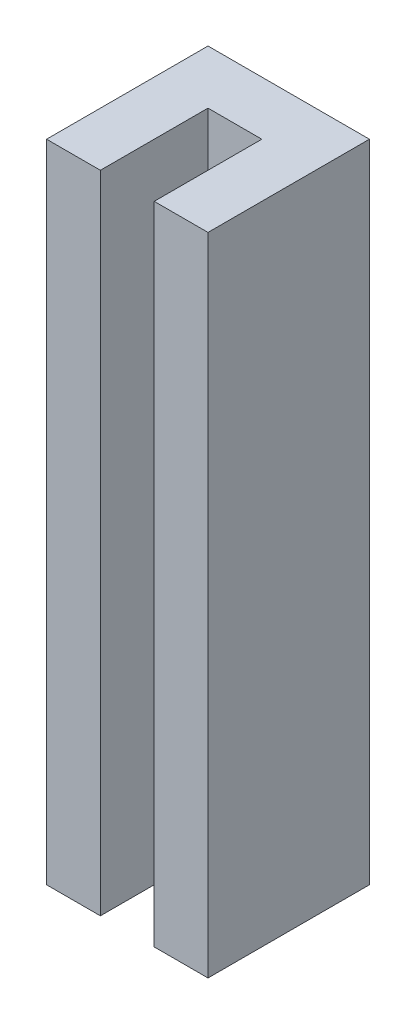
ISO-10303-21;
HEADER;
FILE_DESCRIPTION(('STEP AP214'),'2;1');
FILE_NAME('part.step','',(''),(''),'','','');
FILE_SCHEMA(('AUTOMOTIVE_DESIGN { 1 0 10303 214 1 1 1 1 }'));
ENDSEC;
DATA;
#1=APPLICATION_CONTEXT('core data for automotive mechanical design processes');
#2=APPLICATION_PROTOCOL_DEFINITION('international standard','automotive_design',2000,#1);
#3=PRODUCT_CONTEXT('',#1,'mechanical');
#4=PRODUCT('Part','Part','',(#3));
#5=PRODUCT_RELATED_PRODUCT_CATEGORY('part','',(#4));
#6=PRODUCT_DEFINITION_FORMATION('','',#4);
#7=PRODUCT_DEFINITION_CONTEXT('part definition',#1,'design');
#8=PRODUCT_DEFINITION('design','',#6,#7);
#9=PRODUCT_DEFINITION_SHAPE('','',#8);
#10=(LENGTH_UNIT() NAMED_UNIT(*) SI_UNIT(.MILLI.,.METRE.));
#11=(NAMED_UNIT(*) PLANE_ANGLE_UNIT() SI_UNIT($,.RADIAN.));
#12=(NAMED_UNIT(*) SI_UNIT($,.STERADIAN.) SOLID_ANGLE_UNIT());
#13=UNCERTAINTY_MEASURE_WITH_UNIT(LENGTH_MEASURE(1.E-05),#10,'distance_accuracy_value','');
#14=(GEOMETRIC_REPRESENTATION_CONTEXT(3) GLOBAL_UNCERTAINTY_ASSIGNED_CONTEXT((#13)) GLOBAL_UNIT_ASSIGNED_CONTEXT((#10,
#11,#12)) REPRESENTATION_CONTEXT('',''));
#15=CARTESIAN_POINT('',(0.,0.,0.));
#16=DIRECTION('',(0.,0.,1.));
#17=DIRECTION('',(1.,0.,0.));
#18=AXIS2_PLACEMENT_3D('',#15,#16,#17);
#19=CARTESIAN_POINT('',(4.7625,19.05,4.7625));
#20=DIRECTION('',(-1.,0.,0.));
#21=DIRECTION('',(0.,0.,1.));
#22=AXIS2_PLACEMENT_3D('',#19,#20,#21);
#23=PLANE('',#22);
#24=DIRECTION('',(0.,0.,-1.));
#25=VECTOR('',#24,1.);
#26=CARTESIAN_POINT('',(4.7625,-19.05,4.7625));
#27=LINE('',#26,#25);
#28=CARTESIAN_POINT('',(4.7625,-19.05,4.7625));
#29=VERTEX_POINT('',#28);
#30=CARTESIAN_POINT('',(4.7625,-19.05,-4.7625));
#31=VERTEX_POINT('',#30);
#32=EDGE_CURVE('E128',#29,#31,#27,.T.);
#33=ORIENTED_EDGE('',*,*,#32,.T.);
#34=DIRECTION('',(0.,-1.,0.));
#35=VECTOR('',#34,1.);
#36=CARTESIAN_POINT('',(4.7625,19.05,-4.7625));
#37=LINE('',#36,#35);
#38=CARTESIAN_POINT('',(4.7625,19.05,-4.7625));
#39=VERTEX_POINT('',#38);
#40=EDGE_CURVE('E11',#39,#31,#37,.T.);
#41=ORIENTED_EDGE('',*,*,#40,.F.);
#42=DIRECTION('',(0.,0.,-1.));
#43=VECTOR('',#42,1.);
#44=CARTESIAN_POINT('',(4.7625,19.05,4.7625));
#45=LINE('',#44,#43);
#46=CARTESIAN_POINT('',(4.7625,19.05,4.7625));
#47=VERTEX_POINT('',#46);
#48=EDGE_CURVE('E143',#47,#39,#45,.T.);
#49=ORIENTED_EDGE('',*,*,#48,.F.);
#50=DIRECTION('',(0.,-1.,0.));
#51=VECTOR('',#50,1.);
#52=CARTESIAN_POINT('',(4.7625,19.05,4.7625));
#53=LINE('',#52,#51);
#54=EDGE_CURVE('E124',#47,#29,#53,.T.);
#55=ORIENTED_EDGE('',*,*,#54,.T.);
#56=EDGE_LOOP('',(#33,#41,#49,#55));
#57=FACE_BOUND('',#56,.T.);
#58=ADVANCED_FACE('F30',(#57),#23,.F.);
#59=CARTESIAN_POINT('',(-4.7625,19.05,-4.7625));
#60=DIRECTION('',(0.,0.,1.));
#61=DIRECTION('',(1.,0.,0.));
#62=AXIS2_PLACEMENT_3D('',#59,#60,#61);
#63=PLANE('',#62);
#64=CARTESIAN_POINT('',(0.,7.9375,-4.7625));
#65=DIRECTION('',(0.,0.,-1.));
#66=DIRECTION('',(-1.,0.,0.));
#67=AXIS2_PLACEMENT_3D('',#64,#65,#66);
#68=CIRCLE('',#67,1.42239999999982);
#69=CARTESIAN_POINT('',(-1.42239999999983,7.9375,-4.7625));
#70=VERTEX_POINT('',#69);
#71=EDGE_CURVE('E163',#70,#70,#68,.T.);
#72=ORIENTED_EDGE('',*,*,#71,.F.);
#73=EDGE_LOOP('',(#72));
#74=FACE_BOUND('',#73,.T.);
#75=CARTESIAN_POINT('',(0.,-14.2875,-4.76250000000001));
#76=DIRECTION('',(0.,0.,-1.));
#77=DIRECTION('',(-1.,0.,0.));
#78=AXIS2_PLACEMENT_3D('',#75,#76,#77);
#79=CIRCLE('',#78,1.42239999999982);
#80=CARTESIAN_POINT('',(-1.42239999999983,-14.2875,-4.76250000000001));
#81=VERTEX_POINT('',#80);
#82=EDGE_CURVE('E155',#81,#81,#79,.T.);
#83=ORIENTED_EDGE('',*,*,#82,.F.);
#84=EDGE_LOOP('',(#83));
#85=FACE_BOUND('',#84,.T.);
#86=DIRECTION('',(-1.,0.,0.));
#87=VECTOR('',#86,1.);
#88=CARTESIAN_POINT('',(-4.7625,-19.05,-4.7625));
#89=LINE('',#88,#87);
#90=CARTESIAN_POINT('',(-4.7625,-19.05,-4.7625));
#91=VERTEX_POINT('',#90);
#92=EDGE_CURVE('E131',#31,#91,#89,.T.);
#93=ORIENTED_EDGE('',*,*,#92,.T.);
#94=DIRECTION('',(0.,-1.,0.));
#95=VECTOR('',#94,1.);
#96=CARTESIAN_POINT('',(-4.7625,19.05,-4.7625));
#97=LINE('',#96,#95);
#98=CARTESIAN_POINT('',(-4.7625,19.05,-4.7625));
#99=VERTEX_POINT('',#98);
#100=EDGE_CURVE('E39',#99,#91,#97,.T.);
#101=ORIENTED_EDGE('',*,*,#100,.F.);
#102=DIRECTION('',(-1.,0.,0.));
#103=VECTOR('',#102,1.);
#104=CARTESIAN_POINT('',(-4.7625,19.05,-4.7625));
#105=LINE('',#104,#103);
#106=EDGE_CURVE('E91',#39,#99,#105,.T.);
#107=ORIENTED_EDGE('',*,*,#106,.F.);
#108=ORIENTED_EDGE('',*,*,#40,.T.);
#109=EDGE_LOOP('',(#93,#101,#107,#108));
#110=FACE_BOUND('',#109,.T.);
#111=ADVANCED_FACE('F199',(#74,#85,#110),#63,.F.);
#112=CARTESIAN_POINT('',(-4.7625,19.05,4.7625));
#113=DIRECTION('',(1.,0.,0.));
#114=DIRECTION('',(0.,0.,-1.));
#115=AXIS2_PLACEMENT_3D('',#112,#113,#114);
#116=PLANE('',#115);
#117=DIRECTION('',(0.,0.,1.));
#118=VECTOR('',#117,1.);
#119=CARTESIAN_POINT('',(-4.7625,-19.05,4.7625));
#120=LINE('',#119,#118);
#121=CARTESIAN_POINT('',(-4.7625,-19.05,4.7625));
#122=VERTEX_POINT('',#121);
#123=EDGE_CURVE('E134',#91,#122,#120,.T.);
#124=ORIENTED_EDGE('',*,*,#123,.T.);
#125=DIRECTION('',(0.,-1.,0.));
#126=VECTOR('',#125,1.);
#127=CARTESIAN_POINT('',(-4.7625,19.05,4.7625));
#128=LINE('',#127,#126);
#129=CARTESIAN_POINT('',(-4.7625,19.05,4.7625));
#130=VERTEX_POINT('',#129);
#131=EDGE_CURVE('E150',#130,#122,#128,.T.);
#132=ORIENTED_EDGE('',*,*,#131,.F.);
#133=DIRECTION('',(0.,0.,1.));
#134=VECTOR('',#133,1.);
#135=CARTESIAN_POINT('',(-4.7625,19.05,4.7625));
#136=LINE('',#135,#134);
#137=EDGE_CURVE('E168',#99,#130,#136,.T.);
#138=ORIENTED_EDGE('',*,*,#137,.F.);
#139=ORIENTED_EDGE('',*,*,#100,.T.);
#140=EDGE_LOOP('',(#124,#132,#138,#139));
#141=FACE_BOUND('',#140,.T.);
#142=ADVANCED_FACE('F203',(#141),#116,.F.);
#143=CARTESIAN_POINT('',(-4.7625,19.05,4.7625));
#144=DIRECTION('',(0.,0.,-1.));
#145=DIRECTION('',(-1.,0.,0.));
#146=AXIS2_PLACEMENT_3D('',#143,#144,#145);
#147=PLANE('',#146);
#148=DIRECTION('',(1.,0.,0.));
#149=VECTOR('',#148,1.);
#150=CARTESIAN_POINT('',(-4.7625,-19.05,4.7625));
#151=LINE('',#150,#149);
#152=CARTESIAN_POINT('',(-1.5875,-19.05,4.7625));
#153=VERTEX_POINT('',#152);
#154=EDGE_CURVE('E136',#122,#153,#151,.T.);
#155=ORIENTED_EDGE('',*,*,#154,.T.);
#156=DIRECTION('',(0.,-1.,0.));
#157=VECTOR('',#156,1.);
#158=CARTESIAN_POINT('',(-1.5875,19.05,4.7625));
#159=LINE('',#158,#157);
#160=CARTESIAN_POINT('',(-1.5875,19.05,4.7625));
#161=VERTEX_POINT('',#160);
#162=EDGE_CURVE('E147',#161,#153,#159,.T.);
#163=ORIENTED_EDGE('',*,*,#162,.F.);
#164=DIRECTION('',(1.,0.,0.));
#165=VECTOR('',#164,1.);
#166=CARTESIAN_POINT('',(-4.7625,19.05,4.7625));
#167=LINE('',#166,#165);
#168=EDGE_CURVE('E170',#130,#161,#167,.T.);
#169=ORIENTED_EDGE('',*,*,#168,.F.);
#170=ORIENTED_EDGE('',*,*,#131,.T.);
#171=EDGE_LOOP('',(#155,#163,#169,#170));
#172=FACE_BOUND('',#171,.T.);
#173=ADVANCED_FACE('F176',(#172),#147,.F.);
#174=CARTESIAN_POINT('',(-1.5875,19.05,-1.5875));
#175=DIRECTION('',(-1.,0.,0.));
#176=DIRECTION('',(0.,0.,1.));
#177=AXIS2_PLACEMENT_3D('',#174,#175,#176);
#178=PLANE('',#177);
#179=DIRECTION('',(0.,0.,-1.));
#180=VECTOR('',#179,1.);
#181=CARTESIAN_POINT('',(-1.5875,-19.05,-1.5875));
#182=LINE('',#181,#180);
#183=CARTESIAN_POINT('',(-1.5875,-19.05,-1.5875));
#184=VERTEX_POINT('',#183);
#185=EDGE_CURVE('E138',#153,#184,#182,.T.);
#186=ORIENTED_EDGE('',*,*,#185,.T.);
#187=DIRECTION('',(0.,-1.,0.));
#188=VECTOR('',#187,1.);
#189=CARTESIAN_POINT('',(-1.5875,19.05,-1.5875));
#190=LINE('',#189,#188);
#191=CARTESIAN_POINT('',(-1.5875,19.05,-1.5875));
#192=VERTEX_POINT('',#191);
#193=EDGE_CURVE('E119',#192,#184,#190,.T.);
#194=ORIENTED_EDGE('',*,*,#193,.F.);
#195=DIRECTION('',(0.,0.,-1.));
#196=VECTOR('',#195,1.);
#197=CARTESIAN_POINT('',(-1.5875,19.05,-1.5875));
#198=LINE('',#197,#196);
#199=EDGE_CURVE('E110',#161,#192,#198,.T.);
#200=ORIENTED_EDGE('',*,*,#199,.F.);
#201=ORIENTED_EDGE('',*,*,#162,.T.);
#202=EDGE_LOOP('',(#186,#194,#200,#201));
#203=FACE_BOUND('',#202,.T.);
#204=ADVANCED_FACE('F180',(#203),#178,.F.);
#205=CARTESIAN_POINT('',(-1.5875,19.05,-1.5875));
#206=DIRECTION('',(0.,0.,-1.));
#207=DIRECTION('',(-1.,0.,0.));
#208=AXIS2_PLACEMENT_3D('',#205,#206,#207);
#209=PLANE('',#208);
#210=CARTESIAN_POINT('',(0.,7.9375,-1.5875));
#211=DIRECTION('',(0.,0.,-1.));
#212=DIRECTION('',(-1.,0.,0.));
#213=AXIS2_PLACEMENT_3D('',#210,#211,#212);
#214=CIRCLE('',#213,1.42239999999982);
#215=CARTESIAN_POINT('',(-1.42239999999983,7.9375,-1.5875));
#216=VERTEX_POINT('',#215);
#217=EDGE_CURVE('E33',#216,#216,#214,.T.);
#218=ORIENTED_EDGE('',*,*,#217,.T.);
#219=EDGE_LOOP('',(#218));
#220=FACE_BOUND('',#219,.T.);
#221=CARTESIAN_POINT('',(0.,-14.2875,-1.5875));
#222=DIRECTION('',(0.,0.,-1.));
#223=DIRECTION('',(-1.,0.,0.));
#224=AXIS2_PLACEMENT_3D('',#221,#222,#223);
#225=CIRCLE('',#224,1.42239999999982);
#226=CARTESIAN_POINT('',(-1.42239999999983,-14.2875,-1.5875));
#227=VERTEX_POINT('',#226);
#228=EDGE_CURVE('E132',#227,#227,#225,.T.);
#229=ORIENTED_EDGE('',*,*,#228,.T.);
#230=EDGE_LOOP('',(#229));
#231=FACE_BOUND('',#230,.T.);
#232=DIRECTION('',(1.,0.,0.));
#233=VECTOR('',#232,1.);
#234=CARTESIAN_POINT('',(-1.5875,-19.05,-1.5875));
#235=LINE('',#234,#233);
#236=CARTESIAN_POINT('',(1.5875,-19.05,-1.5875));
#237=VERTEX_POINT('',#236);
#238=EDGE_CURVE('E118',#184,#237,#235,.T.);
#239=ORIENTED_EDGE('',*,*,#238,.T.);
#240=DIRECTION('',(0.,-1.,0.));
#241=VECTOR('',#240,1.);
#242=CARTESIAN_POINT('',(1.5875,19.05,-1.5875));
#243=LINE('',#242,#241);
#244=CARTESIAN_POINT('',(1.5875,19.05,-1.5875));
#245=VERTEX_POINT('',#244);
#246=EDGE_CURVE('E115',#245,#237,#243,.T.);
#247=ORIENTED_EDGE('',*,*,#246,.F.);
#248=DIRECTION('',(1.,0.,0.));
#249=VECTOR('',#248,1.);
#250=CARTESIAN_POINT('',(-1.5875,19.05,-1.5875));
#251=LINE('',#250,#249);
#252=EDGE_CURVE('E104',#192,#245,#251,.T.);
#253=ORIENTED_EDGE('',*,*,#252,.F.);
#254=ORIENTED_EDGE('',*,*,#193,.T.);
#255=EDGE_LOOP('',(#239,#247,#253,#254));
#256=FACE_BOUND('',#255,.T.);
#257=ADVANCED_FACE('F116',(#220,#231,#256),#209,.F.);
#258=CARTESIAN_POINT('',(1.5875,19.05,-1.5875));
#259=DIRECTION('',(1.,0.,0.));
#260=DIRECTION('',(0.,0.,-1.));
#261=AXIS2_PLACEMENT_3D('',#258,#259,#260);
#262=PLANE('',#261);
#263=DIRECTION('',(0.,0.,1.));
#264=VECTOR('',#263,1.);
#265=CARTESIAN_POINT('',(1.5875,-19.05,-1.5875));
#266=LINE('',#265,#264);
#267=CARTESIAN_POINT('',(1.5875,-19.05,4.7625));
#268=VERTEX_POINT('',#267);
#269=EDGE_CURVE('E77',#237,#268,#266,.T.);
#270=ORIENTED_EDGE('',*,*,#269,.T.);
#271=DIRECTION('',(0.,-1.,0.));
#272=VECTOR('',#271,1.);
#273=CARTESIAN_POINT('',(1.5875,19.05,4.7625));
#274=LINE('',#273,#272);
#275=CARTESIAN_POINT('',(1.5875,19.05,4.7625));
#276=VERTEX_POINT('',#275);
#277=EDGE_CURVE('E120',#276,#268,#274,.T.);
#278=ORIENTED_EDGE('',*,*,#277,.F.);
#279=DIRECTION('',(0.,0.,1.));
#280=VECTOR('',#279,1.);
#281=CARTESIAN_POINT('',(1.5875,19.05,-1.5875));
#282=LINE('',#281,#280);
#283=EDGE_CURVE('E108',#245,#276,#282,.T.);
#284=ORIENTED_EDGE('',*,*,#283,.F.);
#285=ORIENTED_EDGE('',*,*,#246,.T.);
#286=EDGE_LOOP('',(#270,#278,#284,#285));
#287=FACE_BOUND('',#286,.T.);
#288=ADVANCED_FACE('F122',(#287),#262,.F.);
#289=CARTESIAN_POINT('',(1.5875,19.05,4.7625));
#290=DIRECTION('',(0.,0.,-1.));
#291=DIRECTION('',(-1.,0.,0.));
#292=AXIS2_PLACEMENT_3D('',#289,#290,#291);
#293=PLANE('',#292);
#294=DIRECTION('',(1.,0.,0.));
#295=VECTOR('',#294,1.);
#296=CARTESIAN_POINT('',(1.5875,-19.05,4.7625));
#297=LINE('',#296,#295);
#298=EDGE_CURVE('E83',#268,#29,#297,.T.);
#299=ORIENTED_EDGE('',*,*,#298,.T.);
#300=ORIENTED_EDGE('',*,*,#54,.F.);
#301=DIRECTION('',(1.,0.,0.));
#302=VECTOR('',#301,1.);
#303=CARTESIAN_POINT('',(1.5875,19.05,4.7625));
#304=LINE('',#303,#302);
#305=EDGE_CURVE('E48',#276,#47,#304,.T.);
#306=ORIENTED_EDGE('',*,*,#305,.F.);
#307=ORIENTED_EDGE('',*,*,#277,.T.);
#308=EDGE_LOOP('',(#299,#300,#306,#307));
#309=FACE_BOUND('',#308,.T.);
#310=ADVANCED_FACE('F188',(#309),#293,.F.);
#311=CARTESIAN_POINT('',(4.7625,19.05,-4.7625));
#312=DIRECTION('',(0.,-1.,0.));
#313=DIRECTION('',(0.,0.,-1.));
#314=AXIS2_PLACEMENT_3D('',#311,#312,#313);
#315=PLANE('',#314);
#316=ORIENTED_EDGE('',*,*,#48,.T.);
#317=ORIENTED_EDGE('',*,*,#106,.T.);
#318=ORIENTED_EDGE('',*,*,#137,.T.);
#319=ORIENTED_EDGE('',*,*,#168,.T.);
#320=ORIENTED_EDGE('',*,*,#199,.T.);
#321=ORIENTED_EDGE('',*,*,#252,.T.);
#322=ORIENTED_EDGE('',*,*,#283,.T.);
#323=ORIENTED_EDGE('',*,*,#305,.T.);
#324=EDGE_LOOP('',(#316,#317,#318,#319,#320,#321,#322,#323));
#325=FACE_BOUND('',#324,.T.);
#326=ADVANCED_FACE('F106',(#325),#315,.F.);
#327=CARTESIAN_POINT('',(4.7625,-19.05,-4.7625));
#328=DIRECTION('',(0.,-1.,0.));
#329=DIRECTION('',(0.,0.,-1.));
#330=AXIS2_PLACEMENT_3D('',#327,#328,#329);
#331=PLANE('',#330);
#332=ORIENTED_EDGE('',*,*,#32,.F.);
#333=ORIENTED_EDGE('',*,*,#298,.F.);
#334=ORIENTED_EDGE('',*,*,#269,.F.);
#335=ORIENTED_EDGE('',*,*,#238,.F.);
#336=ORIENTED_EDGE('',*,*,#185,.F.);
#337=ORIENTED_EDGE('',*,*,#154,.F.);
#338=ORIENTED_EDGE('',*,*,#123,.F.);
#339=ORIENTED_EDGE('',*,*,#92,.F.);
#340=EDGE_LOOP('',(#332,#333,#334,#335,#336,#337,#338,#339));
#341=FACE_BOUND('',#340,.T.);
#342=ADVANCED_FACE('F183',(#341),#331,.T.);
#343=CARTESIAN_POINT('',(0.,-14.2875,-4.76250000000001));
#344=DIRECTION('',(0.,0.,-1.));
#345=DIRECTION('',(-1.,0.,0.));
#346=AXIS2_PLACEMENT_3D('',#343,#344,#345);
#347=CYLINDRICAL_SURFACE('',#346,1.42239999999982);
#348=ORIENTED_EDGE('',*,*,#82,.T.);
#349=EDGE_LOOP('',(#348));
#350=FACE_BOUND('',#349,.T.);
#351=ORIENTED_EDGE('',*,*,#228,.F.);
#352=EDGE_LOOP('',(#351));
#353=FACE_BOUND('',#352,.T.);
#354=ADVANCED_FACE('F225',(#350,#353),#347,.F.);
#355=CARTESIAN_POINT('',(0.,7.9375,-4.7625));
#356=DIRECTION('',(0.,0.,-1.));
#357=DIRECTION('',(-1.,0.,0.));
#358=AXIS2_PLACEMENT_3D('',#355,#356,#357);
#359=CYLINDRICAL_SURFACE('',#358,1.42239999999982);
#360=ORIENTED_EDGE('',*,*,#71,.T.);
#361=EDGE_LOOP('',(#360));
#362=FACE_BOUND('',#361,.T.);
#363=ORIENTED_EDGE('',*,*,#217,.F.);
#364=EDGE_LOOP('',(#363));
#365=FACE_BOUND('',#364,.T.);
#366=ADVANCED_FACE('F223',(#362,#365),#359,.F.);
#367=CLOSED_SHELL('',(#58,#111,#142,#173,#204,#257,#288,#310,#326,#342,#354,#366));
#368=MANIFOLD_SOLID_BREP('B2',#367);
#369=ADVANCED_BREP_SHAPE_REPRESENTATION('',(#18,#368),#14);
#370=SHAPE_DEFINITION_REPRESENTATION(#9,#369);
ENDSEC;
END-ISO-10303-21;
